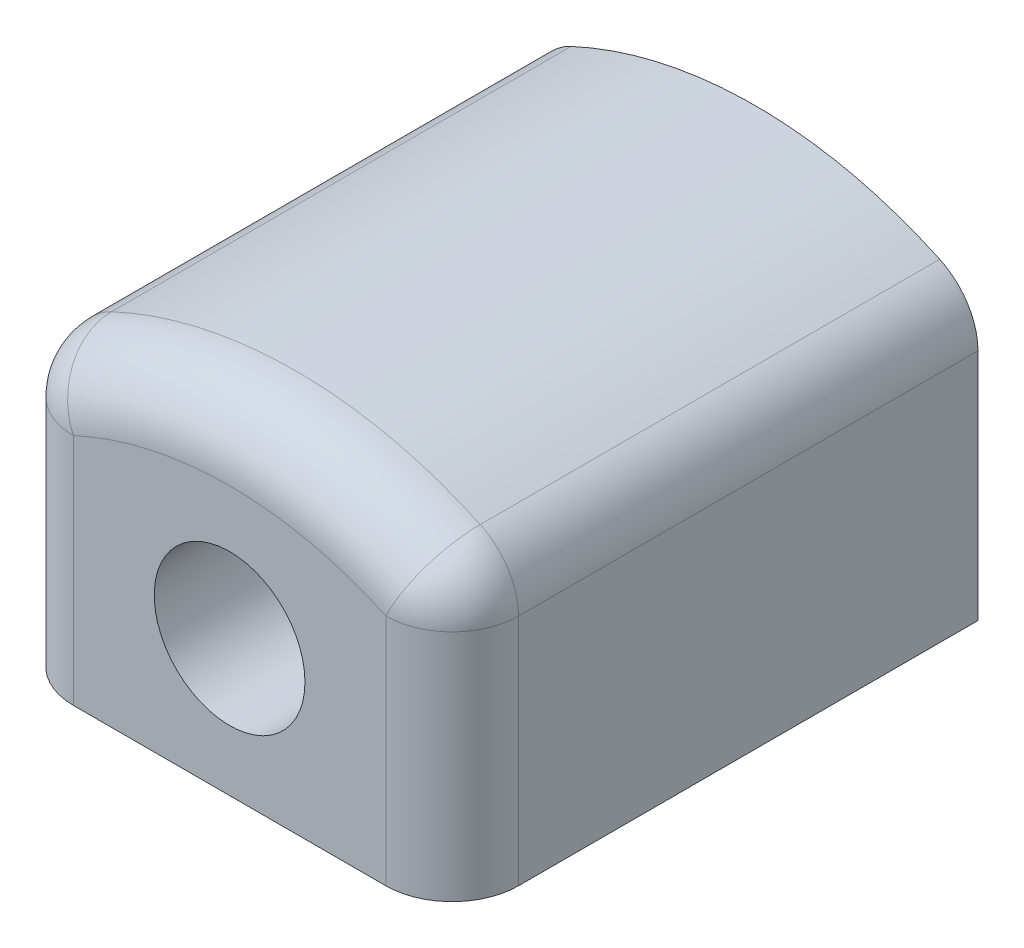
ISO-10303-21;
HEADER;
FILE_DESCRIPTION(('STEP AP214'),'2;1');
FILE_NAME('part.step','',(''),(''),'','','');
FILE_SCHEMA(('AUTOMOTIVE_DESIGN { 1 0 10303 214 1 1 1 1 }'));
ENDSEC;
DATA;
#1=APPLICATION_CONTEXT('core data for automotive mechanical design processes');
#2=APPLICATION_PROTOCOL_DEFINITION('international standard','automotive_design',2000,#1);
#3=PRODUCT_CONTEXT('',#1,'mechanical');
#4=PRODUCT('Part','Part','',(#3));
#5=PRODUCT_RELATED_PRODUCT_CATEGORY('part','',(#4));
#6=PRODUCT_DEFINITION_FORMATION('','',#4);
#7=PRODUCT_DEFINITION_CONTEXT('part definition',#1,'design');
#8=PRODUCT_DEFINITION('design','',#6,#7);
#9=PRODUCT_DEFINITION_SHAPE('','',#8);
#10=(LENGTH_UNIT() NAMED_UNIT(*) SI_UNIT(.MILLI.,.METRE.));
#11=(NAMED_UNIT(*) PLANE_ANGLE_UNIT() SI_UNIT($,.RADIAN.));
#12=(NAMED_UNIT(*) SI_UNIT($,.STERADIAN.) SOLID_ANGLE_UNIT());
#13=UNCERTAINTY_MEASURE_WITH_UNIT(LENGTH_MEASURE(1.E-05),#10,'distance_accuracy_value','');
#14=(GEOMETRIC_REPRESENTATION_CONTEXT(3) GLOBAL_UNCERTAINTY_ASSIGNED_CONTEXT((#13)) GLOBAL_UNIT_ASSIGNED_CONTEXT((#10,
#11,#12)) REPRESENTATION_CONTEXT('',''));
#15=CARTESIAN_POINT('',(0.,0.,0.));
#16=DIRECTION('',(0.,0.,1.));
#17=DIRECTION('',(1.,0.,0.));
#18=AXIS2_PLACEMENT_3D('',#15,#16,#17);
#19=CARTESIAN_POINT('',(16.4591999999991,10.2784021540559,48.387));
#20=DIRECTION('',(1.,0.,0.));
#21=DIRECTION('',(0.,1.,0.));
#22=AXIS2_PLACEMENT_3D('',#19,#20,#21);
#23=SPHERICAL_SURFACE('',#22,6.985);
#24=CARTESIAN_POINT('',(16.4591999999991,10.2784021540559,48.387));
#25=DIRECTION('',(0.906269393546277,-0.422700587084125,0.));
#26=DIRECTION('',(0.422700587084125,0.906269393546277,0.));
#27=AXIS2_PLACEMENT_3D('',#24,#25,#26);
#28=CIRCLE('',#27,6.985);
#29=CARTESIAN_POINT('',(16.4591999999991,10.2784021540559,55.372));
#30=VERTEX_POINT('',#29);
#31=CARTESIAN_POINT('',(19.4117636007817,16.6086938679767,48.387));
#32=VERTEX_POINT('',#31);
#33=EDGE_CURVE('E199',#30,#32,#28,.F.);
#34=ORIENTED_EDGE('',*,*,#33,.F.);
#35=CARTESIAN_POINT('',(16.4591999999991,10.2784021540558,48.387));
#36=DIRECTION('',(0.,-1.,0.));
#37=DIRECTION('',(1.,0.,0.));
#38=AXIS2_PLACEMENT_3D('',#35,#36,#37);
#39=CIRCLE('',#38,6.985);
#40=CARTESIAN_POINT('',(23.4441999999991,10.278402154056,48.387));
#41=VERTEX_POINT('',#40);
#42=EDGE_CURVE('E35',#41,#30,#39,.T.);
#43=ORIENTED_EDGE('',*,*,#42,.F.);
#44=CARTESIAN_POINT('',(16.4591999999991,10.2784021540559,48.387));
#45=DIRECTION('',(0.,0.,1.));
#46=DIRECTION('',(1.,0.,0.));
#47=AXIS2_PLACEMENT_3D('',#44,#45,#46);
#48=CIRCLE('',#47,6.985);
#49=EDGE_CURVE('E133',#32,#41,#48,.F.);
#50=ORIENTED_EDGE('',*,*,#49,.F.);
#51=EDGE_LOOP('',(#34,#43,#50));
#52=FACE_BOUND('',#51,.T.);
#53=ADVANCED_FACE('F16',(#52),#23,.T.);
#54=CARTESIAN_POINT('',(-16.4592000000009,10.2784021540551,48.387));
#55=DIRECTION('',(1.,0.,0.));
#56=DIRECTION('',(0.,1.,0.));
#57=AXIS2_PLACEMENT_3D('',#54,#55,#56);
#58=SPHERICAL_SURFACE('',#57,6.985);
#59=CARTESIAN_POINT('',(-16.4592000000009,10.2784021540551,48.387));
#60=DIRECTION('',(0.906269393546255,0.422700587084172,0.));
#61=DIRECTION('',(-0.422700587084172,0.906269393546255,0.));
#62=AXIS2_PLACEMENT_3D('',#59,#60,#61);
#63=CIRCLE('',#62,6.985);
#64=CARTESIAN_POINT('',(-19.4117636007838,16.6086938679757,48.387));
#65=VERTEX_POINT('',#64);
#66=CARTESIAN_POINT('',(-16.4592000000009,10.2784021540551,55.372));
#67=VERTEX_POINT('',#66);
#68=EDGE_CURVE('E228',#65,#67,#63,.T.);
#69=ORIENTED_EDGE('',*,*,#68,.F.);
#70=CARTESIAN_POINT('',(-16.4592000000009,10.2784021540551,48.387));
#71=DIRECTION('',(0.,0.,1.));
#72=DIRECTION('',(1.,0.,0.));
#73=AXIS2_PLACEMENT_3D('',#70,#71,#72);
#74=CIRCLE('',#73,6.985);
#75=CARTESIAN_POINT('',(-23.4442000000009,10.2784021540548,48.387));
#76=VERTEX_POINT('',#75);
#77=EDGE_CURVE('E124',#76,#65,#74,.F.);
#78=ORIENTED_EDGE('',*,*,#77,.F.);
#79=CARTESIAN_POINT('',(-16.4592000000009,10.2784021540551,48.387));
#80=DIRECTION('',(0.,1.,0.));
#81=DIRECTION('',(-1.,0.,0.));
#82=AXIS2_PLACEMENT_3D('',#79,#80,#81);
#83=CIRCLE('',#82,6.985);
#84=EDGE_CURVE('E118',#67,#76,#83,.F.);
#85=ORIENTED_EDGE('',*,*,#84,.F.);
#86=EDGE_LOOP('',(#69,#78,#85));
#87=FACE_BOUND('',#86,.T.);
#88=ADVANCED_FACE('F146',(#87),#58,.T.);
#89=CARTESIAN_POINT('',(-23.4442,-14.3256,0.));
#90=DIRECTION('',(-1.,0.,0.));
#91=DIRECTION('',(0.,-1.,0.));
#92=AXIS2_PLACEMENT_3D('',#89,#90,#91);
#93=PLANE('',#92);
#94=DIRECTION('',(0.,1.,0.));
#95=VECTOR('',#94,1.);
#96=CARTESIAN_POINT('',(-23.4442000000009,1.52404364757539,0.));
#97=LINE('',#96,#95);
#98=CARTESIAN_POINT('',(-23.4442000000009,10.278402154055,0.));
#99=VERTEX_POINT('',#98);
#100=CARTESIAN_POINT('',(-23.4442000000006,-14.3256,0.));
#101=VERTEX_POINT('',#100);
#102=EDGE_CURVE('E140',#99,#101,#97,.F.);
#103=ORIENTED_EDGE('',*,*,#102,.T.);
#104=DIRECTION('',(0.,0.,1.));
#105=VECTOR('',#104,1.);
#106=CARTESIAN_POINT('',(-23.4442,-14.3256,0.));
#107=LINE('',#106,#105);
#108=CARTESIAN_POINT('',(-23.4442,-14.3256,48.387));
#109=VERTEX_POINT('',#108);
#110=EDGE_CURVE('E100',#109,#101,#107,.F.);
#111=ORIENTED_EDGE('',*,*,#110,.F.);
#112=DIRECTION('',(0.,1.,0.));
#113=VECTOR('',#112,1.);
#114=CARTESIAN_POINT('',(-23.4442000000003,-6.40077817621274,48.387));
#115=LINE('',#114,#113);
#116=EDGE_CURVE('E97',#76,#109,#115,.F.);
#117=ORIENTED_EDGE('',*,*,#116,.F.);
#118=DIRECTION('',(0.,0.,1.));
#119=VECTOR('',#118,1.);
#120=CARTESIAN_POINT('',(-23.4442000000009,10.2784021540548,0.));
#121=LINE('',#120,#119);
#122=EDGE_CURVE('E125',#99,#76,#121,.T.);
#123=ORIENTED_EDGE('',*,*,#122,.F.);
#124=EDGE_LOOP('',(#103,#111,#117,#123));
#125=FACE_BOUND('',#124,.T.);
#126=ADVANCED_FACE('F149',(#125),#93,.T.);
#127=CARTESIAN_POINT('',(23.444199999999,14.4780000000012,0.));
#128=DIRECTION('',(1.,0.,0.));
#129=DIRECTION('',(0.,1.,0.));
#130=AXIS2_PLACEMENT_3D('',#127,#128,#129);
#131=PLANE('',#130);
#132=DIRECTION('',(0.,1.,0.));
#133=VECTOR('',#132,1.);
#134=CARTESIAN_POINT('',(23.4442,1.52404364757539,0.));
#135=LINE('',#134,#133);
#136=CARTESIAN_POINT('',(23.4442,-14.3256,0.));
#137=VERTEX_POINT('',#136);
#138=CARTESIAN_POINT('',(23.4441999999995,10.2784021540559,0.));
#139=VERTEX_POINT('',#138);
#140=EDGE_CURVE('E139',#137,#139,#135,.T.);
#141=ORIENTED_EDGE('',*,*,#140,.T.);
#142=DIRECTION('',(0.,0.,1.));
#143=VECTOR('',#142,1.);
#144=CARTESIAN_POINT('',(23.4441999999991,10.2784021540559,0.));
#145=LINE('',#144,#143);
#146=EDGE_CURVE('E131',#41,#139,#145,.F.);
#147=ORIENTED_EDGE('',*,*,#146,.F.);
#148=DIRECTION('',(0.,-1.,0.));
#149=VECTOR('',#148,1.);
#150=CARTESIAN_POINT('',(23.4441999999992,8.00102182378873,48.387));
#151=LINE('',#150,#149);
#152=CARTESIAN_POINT('',(23.4442,-14.3255999999999,48.387));
#153=VERTEX_POINT('',#152);
#154=EDGE_CURVE('E200',#153,#41,#151,.F.);
#155=ORIENTED_EDGE('',*,*,#154,.F.);
#156=DIRECTION('',(0.,0.,1.));
#157=VECTOR('',#156,1.);
#158=CARTESIAN_POINT('',(23.4442,-14.3256,0.));
#159=LINE('',#158,#157);
#160=EDGE_CURVE('E111',#137,#153,#159,.T.);
#161=ORIENTED_EDGE('',*,*,#160,.F.);
#162=EDGE_LOOP('',(#141,#147,#155,#161));
#163=FACE_BOUND('',#162,.T.);
#164=ADVANCED_FACE('F153',(#163),#131,.T.);
#165=CARTESIAN_POINT('',(16.4591999999991,10.2784021540559,0.));
#166=DIRECTION('',(0.,0.,1.));
#167=DIRECTION('',(1.,0.,0.));
#168=AXIS2_PLACEMENT_3D('',#165,#166,#167);
#169=CYLINDRICAL_SURFACE('',#168,6.985);
#170=ORIENTED_EDGE('',*,*,#49,.T.);
#171=ORIENTED_EDGE('',*,*,#146,.T.);
#172=CARTESIAN_POINT('',(16.4591999999991,10.2784021540559,0.));
#173=DIRECTION('',(0.,0.,1.));
#174=DIRECTION('',(1.,0.,0.));
#175=AXIS2_PLACEMENT_3D('',#172,#173,#174);
#176=CIRCLE('',#175,6.985);
#177=CARTESIAN_POINT('',(19.4117636007817,16.6086938679767,0.));
#178=VERTEX_POINT('',#177);
#179=EDGE_CURVE('E225',#139,#178,#176,.T.);
#180=ORIENTED_EDGE('',*,*,#179,.T.);
#181=DIRECTION('',(0.,0.,1.));
#182=VECTOR('',#181,1.);
#183=CARTESIAN_POINT('',(19.4117636007817,16.6086938679767,0.));
#184=LINE('',#183,#182);
#185=EDGE_CURVE('E127',#32,#178,#184,.F.);
#186=ORIENTED_EDGE('',*,*,#185,.F.);
#187=EDGE_LOOP('',(#170,#171,#180,#186));
#188=FACE_BOUND('',#187,.T.);
#189=ADVANCED_FACE('F157',(#188),#169,.T.);
#190=CARTESIAN_POINT('',(0.,-25.0100967457277,0.));
#191=DIRECTION('',(0.,0.,1.));
#192=DIRECTION('',(1.,0.,0.));
#193=AXIS2_PLACEMENT_3D('',#190,#191,#192);
#194=CYLINDRICAL_SURFACE('',#193,45.9232);
#195=ORIENTED_EDGE('',*,*,#185,.T.);
#196=CARTESIAN_POINT('',(0.,-25.0100967457277,0.));
#197=DIRECTION('',(0.,0.,1.));
#198=DIRECTION('',(1.,0.,0.));
#199=AXIS2_PLACEMENT_3D('',#196,#197,#198);
#200=CIRCLE('',#199,45.9232);
#201=CARTESIAN_POINT('',(-19.4117636007838,16.6086938679757,0.));
#202=VERTEX_POINT('',#201);
#203=EDGE_CURVE('E222',#178,#202,#200,.T.);
#204=ORIENTED_EDGE('',*,*,#203,.T.);
#205=DIRECTION('',(0.,0.,1.));
#206=VECTOR('',#205,1.);
#207=CARTESIAN_POINT('',(-19.4117636007838,16.6086938679757,0.));
#208=LINE('',#207,#206);
#209=EDGE_CURVE('E120',#65,#202,#208,.F.);
#210=ORIENTED_EDGE('',*,*,#209,.F.);
#211=CARTESIAN_POINT('',(0.,-25.0100967457277,48.387));
#212=DIRECTION('',(0.,0.,-1.));
#213=DIRECTION('',(1.,0.,0.));
#214=AXIS2_PLACEMENT_3D('',#211,#212,#213);
#215=CIRCLE('',#214,45.9232);
#216=EDGE_CURVE('E145',#32,#65,#215,.F.);
#217=ORIENTED_EDGE('',*,*,#216,.F.);
#218=EDGE_LOOP('',(#195,#204,#210,#217));
#219=FACE_BOUND('',#218,.T.);
#220=ADVANCED_FACE('F161',(#219),#194,.T.);
#221=CARTESIAN_POINT('',(-16.4592000000009,10.2784021540551,0.));
#222=DIRECTION('',(0.,0.,1.));
#223=DIRECTION('',(1.,0.,0.));
#224=AXIS2_PLACEMENT_3D('',#221,#222,#223);
#225=CYLINDRICAL_SURFACE('',#224,6.985);
#226=ORIENTED_EDGE('',*,*,#77,.T.);
#227=ORIENTED_EDGE('',*,*,#209,.T.);
#228=CARTESIAN_POINT('',(-16.4592000000009,10.2784021540551,0.));
#229=DIRECTION('',(0.,0.,1.));
#230=DIRECTION('',(1.,0.,0.));
#231=AXIS2_PLACEMENT_3D('',#228,#229,#230);
#232=CIRCLE('',#231,6.985);
#233=EDGE_CURVE('E91',#202,#99,#232,.T.);
#234=ORIENTED_EDGE('',*,*,#233,.T.);
#235=ORIENTED_EDGE('',*,*,#122,.T.);
#236=EDGE_LOOP('',(#226,#227,#234,#235));
#237=FACE_BOUND('',#236,.T.);
#238=ADVANCED_FACE('F165',(#237),#225,.T.);
#239=CARTESIAN_POINT('',(-16.4592000000003,-6.40077817621249,48.387));
#240=DIRECTION('',(0.,1.,0.));
#241=DIRECTION('',(-1.,0.,0.));
#242=AXIS2_PLACEMENT_3D('',#239,#240,#241);
#243=CYLINDRICAL_SURFACE('',#242,6.985);
#244=ORIENTED_EDGE('',*,*,#84,.T.);
#245=ORIENTED_EDGE('',*,*,#116,.T.);
#246=CARTESIAN_POINT('',(-16.4592,-14.3255999999997,48.387));
#247=DIRECTION('',(0.,1.,0.));
#248=DIRECTION('',(-1.,0.,0.));
#249=AXIS2_PLACEMENT_3D('',#246,#247,#248);
#250=CIRCLE('',#249,6.985);
#251=CARTESIAN_POINT('',(-16.4592000000005,-14.3255999999999,55.372));
#252=VERTEX_POINT('',#251);
#253=EDGE_CURVE('E20',#252,#109,#250,.F.);
#254=ORIENTED_EDGE('',*,*,#253,.F.);
#255=DIRECTION('',(0.,1.,0.));
#256=VECTOR('',#255,1.);
#257=CARTESIAN_POINT('',(-16.4592000000009,1.52404364757539,55.372));
#258=LINE('',#257,#256);
#259=EDGE_CURVE('E80',#67,#252,#258,.F.);
#260=ORIENTED_EDGE('',*,*,#259,.F.);
#261=EDGE_LOOP('',(#244,#245,#254,#260));
#262=FACE_BOUND('',#261,.T.);
#263=ADVANCED_FACE('F95',(#262),#243,.T.);
#264=CARTESIAN_POINT('',(23.4442,-14.3256,0.));
#265=DIRECTION('',(0.,-1.,0.));
#266=DIRECTION('',(1.,0.,0.));
#267=AXIS2_PLACEMENT_3D('',#264,#265,#266);
#268=PLANE('',#267);
#269=CARTESIAN_POINT('',(16.4592,-14.3256,48.387));
#270=DIRECTION('',(0.,-1.,0.));
#271=DIRECTION('',(1.,0.,0.));
#272=AXIS2_PLACEMENT_3D('',#269,#270,#271);
#273=CIRCLE('',#272,6.985);
#274=CARTESIAN_POINT('',(16.4592,-14.3256,55.372));
#275=VERTEX_POINT('',#274);
#276=EDGE_CURVE('E103',#275,#153,#273,.F.);
#277=ORIENTED_EDGE('',*,*,#276,.F.);
#278=DIRECTION('',(1.,0.,0.));
#279=VECTOR('',#278,1.);
#280=CARTESIAN_POINT('',(-6.54355135710892E-13,-14.3256,55.372));
#281=LINE('',#280,#279);
#282=EDGE_CURVE('E84',#252,#275,#281,.T.);
#283=ORIENTED_EDGE('',*,*,#282,.F.);
#284=ORIENTED_EDGE('',*,*,#253,.T.);
#285=ORIENTED_EDGE('',*,*,#110,.T.);
#286=DIRECTION('',(1.,0.,0.));
#287=VECTOR('',#286,1.);
#288=CARTESIAN_POINT('',(-6.54355135710892E-13,-14.3256,0.));
#289=LINE('',#288,#287);
#290=EDGE_CURVE('E136',#101,#137,#289,.T.);
#291=ORIENTED_EDGE('',*,*,#290,.T.);
#292=ORIENTED_EDGE('',*,*,#160,.T.);
#293=EDGE_LOOP('',(#277,#283,#284,#285,#291,#292));
#294=FACE_BOUND('',#293,.T.);
#295=ADVANCED_FACE('F101',(#294),#268,.T.);
#296=CARTESIAN_POINT('',(16.4591999999992,8.00102182378848,48.387));
#297=DIRECTION('',(0.,-1.,0.));
#298=DIRECTION('',(1.,0.,0.));
#299=AXIS2_PLACEMENT_3D('',#296,#297,#298);
#300=CYLINDRICAL_SURFACE('',#299,6.985);
#301=ORIENTED_EDGE('',*,*,#42,.T.);
#302=DIRECTION('',(0.,1.,0.));
#303=VECTOR('',#302,1.);
#304=CARTESIAN_POINT('',(16.4592,1.52404364757539,55.372));
#305=LINE('',#304,#303);
#306=EDGE_CURVE('E104',#275,#30,#305,.T.);
#307=ORIENTED_EDGE('',*,*,#306,.F.);
#308=ORIENTED_EDGE('',*,*,#276,.T.);
#309=ORIENTED_EDGE('',*,*,#154,.T.);
#310=EDGE_LOOP('',(#301,#307,#308,#309));
#311=FACE_BOUND('',#310,.T.);
#312=ADVANCED_FACE('F174',(#311),#300,.T.);
#313=CARTESIAN_POINT('',(0.,-25.0100967457277,48.387));
#314=DIRECTION('',(0.,0.,-1.));
#315=DIRECTION('',(1.,0.,0.));
#316=AXIS2_PLACEMENT_3D('',#313,#314,#315);
#317=TOROIDAL_SURFACE('',#316,38.9382,6.985);
#318=ORIENTED_EDGE('',*,*,#68,.T.);
#319=CARTESIAN_POINT('',(0.,-25.0100967457277,55.372));
#320=DIRECTION('',(0.,0.,-1.));
#321=DIRECTION('',(-0.422700587084172,0.906269393546255,0.));
#322=AXIS2_PLACEMENT_3D('',#319,#320,#321);
#323=CIRCLE('',#322,38.9382);
#324=EDGE_CURVE('E87',#30,#67,#323,.F.);
#325=ORIENTED_EDGE('',*,*,#324,.F.);
#326=ORIENTED_EDGE('',*,*,#33,.T.);
#327=ORIENTED_EDGE('',*,*,#216,.T.);
#328=EDGE_LOOP('',(#318,#325,#326,#327));
#329=FACE_BOUND('',#328,.T.);
#330=ADVANCED_FACE('F177',(#329),#317,.T.);
#331=CARTESIAN_POINT('',(-6.54355135710892E-13,1.52404364757539,0.));
#332=DIRECTION('',(0.,0.,1.));
#333=DIRECTION('',(1.,0.,0.));
#334=AXIS2_PLACEMENT_3D('',#331,#332,#333);
#335=PLANE('',#334);
#336=CARTESIAN_POINT('',(0.,0.,0.));
#337=DIRECTION('',(0.,0.,1.));
#338=DIRECTION('',(1.,0.,0.));
#339=AXIS2_PLACEMENT_3D('',#336,#337,#338);
#340=CIRCLE('',#339,7.9375);
#341=CARTESIAN_POINT('',(7.9375,0.,0.));
#342=VERTEX_POINT('',#341);
#343=EDGE_CURVE('E26',#342,#342,#340,.T.);
#344=ORIENTED_EDGE('',*,*,#343,.T.);
#345=EDGE_LOOP('',(#344));
#346=FACE_BOUND('',#345,.T.);
#347=ORIENTED_EDGE('',*,*,#203,.F.);
#348=ORIENTED_EDGE('',*,*,#179,.F.);
#349=ORIENTED_EDGE('',*,*,#140,.F.);
#350=ORIENTED_EDGE('',*,*,#290,.F.);
#351=ORIENTED_EDGE('',*,*,#102,.F.);
#352=ORIENTED_EDGE('',*,*,#233,.F.);
#353=EDGE_LOOP('',(#347,#348,#349,#350,#351,#352));
#354=FACE_BOUND('',#353,.T.);
#355=ADVANCED_FACE('F182',(#346,#354),#335,.F.);
#356=CARTESIAN_POINT('',(-6.54355135710892E-13,1.52404364757539,55.372));
#357=DIRECTION('',(0.,0.,1.));
#358=DIRECTION('',(1.,0.,0.));
#359=AXIS2_PLACEMENT_3D('',#356,#357,#358);
#360=PLANE('',#359);
#361=CARTESIAN_POINT('',(0.,0.,55.372));
#362=DIRECTION('',(0.,0.,1.));
#363=DIRECTION('',(1.,0.,0.));
#364=AXIS2_PLACEMENT_3D('',#361,#362,#363);
#365=CIRCLE('',#364,7.9375);
#366=CARTESIAN_POINT('',(7.9375,0.,55.372));
#367=VERTEX_POINT('',#366);
#368=EDGE_CURVE('E11',#367,#367,#365,.F.);
#369=ORIENTED_EDGE('',*,*,#368,.T.);
#370=EDGE_LOOP('',(#369));
#371=FACE_BOUND('',#370,.T.);
#372=ORIENTED_EDGE('',*,*,#306,.T.);
#373=ORIENTED_EDGE('',*,*,#324,.T.);
#374=ORIENTED_EDGE('',*,*,#259,.T.);
#375=ORIENTED_EDGE('',*,*,#282,.T.);
#376=EDGE_LOOP('',(#372,#373,#374,#375));
#377=FACE_BOUND('',#376,.T.);
#378=ADVANCED_FACE('F82',(#371,#377),#360,.T.);
#379=CARTESIAN_POINT('',(0.,0.,-80.6619281049167));
#380=DIRECTION('',(0.,0.,1.));
#381=DIRECTION('',(1.,0.,0.));
#382=AXIS2_PLACEMENT_3D('',#379,#380,#381);
#383=CYLINDRICAL_SURFACE('',#382,7.9375);
#384=ORIENTED_EDGE('',*,*,#368,.F.);
#385=EDGE_LOOP('',(#384));
#386=FACE_BOUND('',#385,.T.);
#387=ORIENTED_EDGE('',*,*,#343,.F.);
#388=EDGE_LOOP('',(#387));
#389=FACE_BOUND('',#388,.T.);
#390=ADVANCED_FACE('F268',(#386,#389),#383,.F.);
#391=CLOSED_SHELL('',(#53,#88,#126,#164,#189,#220,#238,#263,#295,#312,#330,#355,#378,#390));
#392=MANIFOLD_SOLID_BREP('B1',#391);
#393=ADVANCED_BREP_SHAPE_REPRESENTATION('',(#18,#392),#14);
#394=SHAPE_DEFINITION_REPRESENTATION(#9,#393);
ENDSEC;
END-ISO-10303-21;
